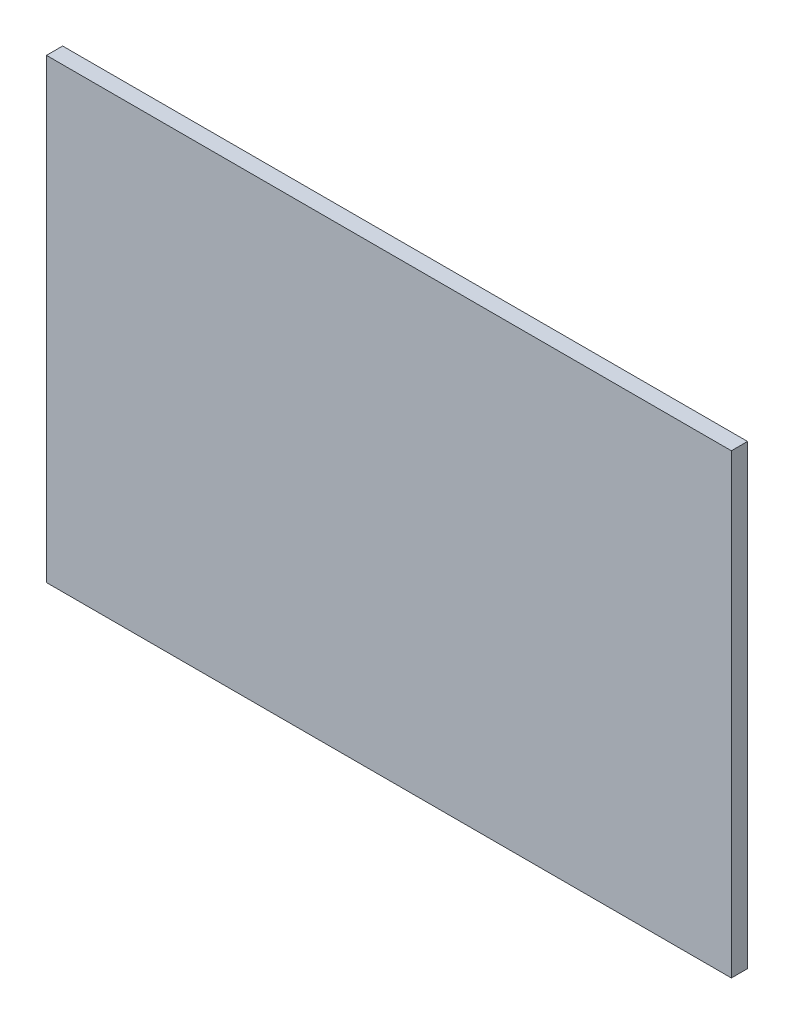
ISO-10303-21;
HEADER;
FILE_DESCRIPTION(('STEP AP214'),'2;1');
FILE_NAME('part.step','',(''),(''),'','','');
FILE_SCHEMA(('AUTOMOTIVE_DESIGN { 1 0 10303 214 1 1 1 1 }'));
ENDSEC;
DATA;
#1=APPLICATION_CONTEXT('core data for automotive mechanical design processes');
#2=APPLICATION_PROTOCOL_DEFINITION('international standard','automotive_design',2000,#1);
#3=PRODUCT_CONTEXT('',#1,'mechanical');
#4=PRODUCT('Part','Part','',(#3));
#5=PRODUCT_RELATED_PRODUCT_CATEGORY('part','',(#4));
#6=PRODUCT_DEFINITION_FORMATION('','',#4);
#7=PRODUCT_DEFINITION_CONTEXT('part definition',#1,'design');
#8=PRODUCT_DEFINITION('design','',#6,#7);
#9=PRODUCT_DEFINITION_SHAPE('','',#8);
#10=(LENGTH_UNIT() NAMED_UNIT(*) SI_UNIT(.MILLI.,.METRE.));
#11=(NAMED_UNIT(*) PLANE_ANGLE_UNIT() SI_UNIT($,.RADIAN.));
#12=(NAMED_UNIT(*) SI_UNIT($,.STERADIAN.) SOLID_ANGLE_UNIT());
#13=UNCERTAINTY_MEASURE_WITH_UNIT(LENGTH_MEASURE(1.E-05),#10,'distance_accuracy_value','');
#14=(GEOMETRIC_REPRESENTATION_CONTEXT(3) GLOBAL_UNCERTAINTY_ASSIGNED_CONTEXT((#13)) GLOBAL_UNIT_ASSIGNED_CONTEXT((#10,
#11,#12)) REPRESENTATION_CONTEXT('',''));
#15=CARTESIAN_POINT('',(0.,0.,0.));
#16=DIRECTION('',(0.,0.,1.));
#17=DIRECTION('',(1.,0.,0.));
#18=AXIS2_PLACEMENT_3D('',#15,#16,#17);
#19=CARTESIAN_POINT('',(-40.26,-26.84,1.9));
#20=DIRECTION('',(1.,0.,0.));
#21=DIRECTION('',(0.,0.,-1.));
#22=AXIS2_PLACEMENT_3D('',#19,#20,#21);
#23=PLANE('',#22);
#24=DIRECTION('',(0.,-1.,0.));
#25=VECTOR('',#24,1.);
#26=CARTESIAN_POINT('',(-40.26,-26.84,0.));
#27=LINE('',#26,#25);
#28=CARTESIAN_POINT('',(-40.26,26.84,0.));
#29=VERTEX_POINT('',#28);
#30=CARTESIAN_POINT('',(-40.26,-26.84,0.));
#31=VERTEX_POINT('',#30);
#32=EDGE_CURVE('E105',#29,#31,#27,.T.);
#33=ORIENTED_EDGE('',*,*,#32,.T.);
#34=DIRECTION('',(0.,0.,-1.));
#35=VECTOR('',#34,1.);
#36=CARTESIAN_POINT('',(-40.26,-26.84,1.9));
#37=LINE('',#36,#35);
#38=CARTESIAN_POINT('',(-40.26,-26.84,1.9));
#39=VERTEX_POINT('',#38);
#40=EDGE_CURVE('E11',#39,#31,#37,.T.);
#41=ORIENTED_EDGE('',*,*,#40,.F.);
#42=DIRECTION('',(0.,-1.,0.));
#43=VECTOR('',#42,1.);
#44=CARTESIAN_POINT('',(-40.26,-26.84,1.9));
#45=LINE('',#44,#43);
#46=CARTESIAN_POINT('',(-40.26,26.84,1.9));
#47=VERTEX_POINT('',#46);
#48=EDGE_CURVE('E89',#47,#39,#45,.T.);
#49=ORIENTED_EDGE('',*,*,#48,.F.);
#50=DIRECTION('',(0.,0.,-1.));
#51=VECTOR('',#50,1.);
#52=CARTESIAN_POINT('',(-40.26,26.84,1.9));
#53=LINE('',#52,#51);
#54=EDGE_CURVE('E97',#47,#29,#53,.T.);
#55=ORIENTED_EDGE('',*,*,#54,.T.);
#56=EDGE_LOOP('',(#33,#41,#49,#55));
#57=FACE_BOUND('',#56,.T.);
#58=ADVANCED_FACE('F39',(#57),#23,.F.);
#59=CARTESIAN_POINT('',(40.26,-26.84,1.9));
#60=DIRECTION('',(0.,1.,0.));
#61=DIRECTION('',(-1.,0.,0.));
#62=AXIS2_PLACEMENT_3D('',#59,#60,#61);
#63=PLANE('',#62);
#64=DIRECTION('',(1.,0.,0.));
#65=VECTOR('',#64,1.);
#66=CARTESIAN_POINT('',(40.26,-26.84,0.));
#67=LINE('',#66,#65);
#68=CARTESIAN_POINT('',(40.26,-26.84,0.));
#69=VERTEX_POINT('',#68);
#70=EDGE_CURVE('E92',#31,#69,#67,.T.);
#71=ORIENTED_EDGE('',*,*,#70,.T.);
#72=DIRECTION('',(0.,0.,-1.));
#73=VECTOR('',#72,1.);
#74=CARTESIAN_POINT('',(40.26,-26.84,1.9));
#75=LINE('',#74,#73);
#76=CARTESIAN_POINT('',(40.26,-26.84,1.9));
#77=VERTEX_POINT('',#76);
#78=EDGE_CURVE('E50',#77,#69,#75,.T.);
#79=ORIENTED_EDGE('',*,*,#78,.F.);
#80=DIRECTION('',(1.,0.,0.));
#81=VECTOR('',#80,1.);
#82=CARTESIAN_POINT('',(40.26,-26.84,1.9));
#83=LINE('',#82,#81);
#84=EDGE_CURVE('E82',#39,#77,#83,.T.);
#85=ORIENTED_EDGE('',*,*,#84,.F.);
#86=ORIENTED_EDGE('',*,*,#40,.T.);
#87=EDGE_LOOP('',(#71,#79,#85,#86));
#88=FACE_BOUND('',#87,.T.);
#89=ADVANCED_FACE('F93',(#88),#63,.F.);
#90=CARTESIAN_POINT('',(40.26,-26.84,1.9));
#91=DIRECTION('',(-1.,0.,0.));
#92=DIRECTION('',(0.,0.,1.));
#93=AXIS2_PLACEMENT_3D('',#90,#91,#92);
#94=PLANE('',#93);
#95=DIRECTION('',(0.,1.,0.));
#96=VECTOR('',#95,1.);
#97=CARTESIAN_POINT('',(40.26,-26.84,0.));
#98=LINE('',#97,#96);
#99=CARTESIAN_POINT('',(40.26,26.84,0.));
#100=VERTEX_POINT('',#99);
#101=EDGE_CURVE('E74',#69,#100,#98,.T.);
#102=ORIENTED_EDGE('',*,*,#101,.T.);
#103=DIRECTION('',(0.,0.,-1.));
#104=VECTOR('',#103,1.);
#105=CARTESIAN_POINT('',(40.26,26.84,1.9));
#106=LINE('',#105,#104);
#107=CARTESIAN_POINT('',(40.26,26.84,1.9));
#108=VERTEX_POINT('',#107);
#109=EDGE_CURVE('E94',#108,#100,#106,.T.);
#110=ORIENTED_EDGE('',*,*,#109,.F.);
#111=DIRECTION('',(0.,1.,0.));
#112=VECTOR('',#111,1.);
#113=CARTESIAN_POINT('',(40.26,-26.84,1.9));
#114=LINE('',#113,#112);
#115=EDGE_CURVE('E88',#77,#108,#114,.T.);
#116=ORIENTED_EDGE('',*,*,#115,.F.);
#117=ORIENTED_EDGE('',*,*,#78,.T.);
#118=EDGE_LOOP('',(#102,#110,#116,#117));
#119=FACE_BOUND('',#118,.T.);
#120=ADVANCED_FACE('F96',(#119),#94,.F.);
#121=CARTESIAN_POINT('',(40.26,26.84,1.9));
#122=DIRECTION('',(0.,-1.,0.));
#123=DIRECTION('',(1.,0.,0.));
#124=AXIS2_PLACEMENT_3D('',#121,#122,#123);
#125=PLANE('',#124);
#126=DIRECTION('',(-1.,0.,0.));
#127=VECTOR('',#126,1.);
#128=CARTESIAN_POINT('',(40.26,26.84,0.));
#129=LINE('',#128,#127);
#130=EDGE_CURVE('E76',#100,#29,#129,.T.);
#131=ORIENTED_EDGE('',*,*,#130,.T.);
#132=ORIENTED_EDGE('',*,*,#54,.F.);
#133=DIRECTION('',(-1.,0.,0.));
#134=VECTOR('',#133,1.);
#135=CARTESIAN_POINT('',(40.26,26.84,1.9));
#136=LINE('',#135,#134);
#137=EDGE_CURVE('E54',#108,#47,#136,.T.);
#138=ORIENTED_EDGE('',*,*,#137,.F.);
#139=ORIENTED_EDGE('',*,*,#109,.T.);
#140=EDGE_LOOP('',(#131,#132,#138,#139));
#141=FACE_BOUND('',#140,.T.);
#142=ADVANCED_FACE('F106',(#141),#125,.F.);
#143=CARTESIAN_POINT('',(0.,0.,1.9));
#144=DIRECTION('',(0.,0.,1.));
#145=DIRECTION('',(1.,0.,0.));
#146=AXIS2_PLACEMENT_3D('',#143,#144,#145);
#147=PLANE('',#146);
#148=ORIENTED_EDGE('',*,*,#48,.T.);
#149=ORIENTED_EDGE('',*,*,#84,.T.);
#150=ORIENTED_EDGE('',*,*,#115,.T.);
#151=ORIENTED_EDGE('',*,*,#137,.T.);
#152=EDGE_LOOP('',(#148,#149,#150,#151));
#153=FACE_BOUND('',#152,.T.);
#154=ADVANCED_FACE('F86',(#153),#147,.T.);
#155=CARTESIAN_POINT('',(0.,0.,0.));
#156=DIRECTION('',(0.,0.,1.));
#157=DIRECTION('',(1.,0.,0.));
#158=AXIS2_PLACEMENT_3D('',#155,#156,#157);
#159=PLANE('',#158);
#160=ORIENTED_EDGE('',*,*,#32,.F.);
#161=ORIENTED_EDGE('',*,*,#130,.F.);
#162=ORIENTED_EDGE('',*,*,#101,.F.);
#163=ORIENTED_EDGE('',*,*,#70,.F.);
#164=EDGE_LOOP('',(#160,#161,#162,#163));
#165=FACE_BOUND('',#164,.T.);
#166=ADVANCED_FACE('F115',(#165),#159,.F.);
#167=CLOSED_SHELL('',(#58,#89,#120,#142,#154,#166));
#168=MANIFOLD_SOLID_BREP('B2',#167);
#169=ADVANCED_BREP_SHAPE_REPRESENTATION('',(#18,#168),#14);
#170=SHAPE_DEFINITION_REPRESENTATION(#9,#169);
ENDSEC;
END-ISO-10303-21;
